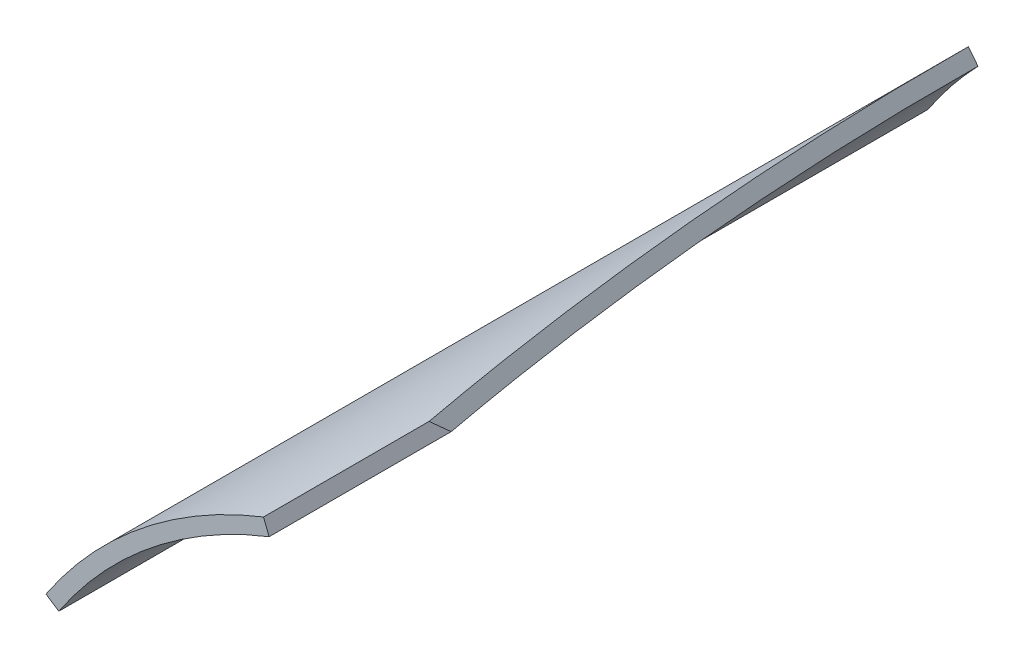
ISO-10303-21;
HEADER;
FILE_DESCRIPTION(('STEP AP214'),'2;1');
FILE_NAME('part.step','',(''),(''),'','','');
FILE_SCHEMA(('AUTOMOTIVE_DESIGN { 1 0 10303 214 1 1 1 1 }'));
ENDSEC;
DATA;
#1=APPLICATION_CONTEXT('core data for automotive mechanical design processes');
#2=APPLICATION_PROTOCOL_DEFINITION('international standard','automotive_design',2000,#1);
#3=PRODUCT_CONTEXT('',#1,'mechanical');
#4=PRODUCT('Part','Part','',(#3));
#5=PRODUCT_RELATED_PRODUCT_CATEGORY('part','',(#4));
#6=PRODUCT_DEFINITION_FORMATION('','',#4);
#7=PRODUCT_DEFINITION_CONTEXT('part definition',#1,'design');
#8=PRODUCT_DEFINITION('design','',#6,#7);
#9=PRODUCT_DEFINITION_SHAPE('','',#8);
#10=(LENGTH_UNIT() NAMED_UNIT(*) SI_UNIT(.MILLI.,.METRE.));
#11=(NAMED_UNIT(*) PLANE_ANGLE_UNIT() SI_UNIT($,.RADIAN.));
#12=(NAMED_UNIT(*) SI_UNIT($,.STERADIAN.) SOLID_ANGLE_UNIT());
#13=UNCERTAINTY_MEASURE_WITH_UNIT(LENGTH_MEASURE(1.E-05),#10,'distance_accuracy_value','');
#14=(GEOMETRIC_REPRESENTATION_CONTEXT(3) GLOBAL_UNCERTAINTY_ASSIGNED_CONTEXT((#13)) GLOBAL_UNIT_ASSIGNED_CONTEXT((#10,
#11,#12)) REPRESENTATION_CONTEXT('',''));
#15=CARTESIAN_POINT('',(0.,0.,0.));
#16=DIRECTION('',(0.,0.,1.));
#17=DIRECTION('',(1.,0.,0.));
#18=AXIS2_PLACEMENT_3D('',#15,#16,#17);
#19=CARTESIAN_POINT('',(0.,0.,-539.));
#20=DIRECTION('',(0.,0.,1.));
#21=DIRECTION('',(1.,0.,0.));
#22=AXIS2_PLACEMENT_3D('',#19,#20,#21);
#23=CYLINDRICAL_SURFACE('',#22,76.);
#24=CARTESIAN_POINT('',(0.,0.,-539.));
#25=DIRECTION('',(0.,0.,-1.));
#26=DIRECTION('',(1.,0.,0.));
#27=AXIS2_PLACEMENT_3D('',#24,#25,#26);
#28=CIRCLE('',#27,76.);
#29=CARTESIAN_POINT('',(-63.3020142939677,42.057757742494,-539.));
#30=VERTEX_POINT('',#29);
#31=CARTESIAN_POINT('',(-54.8388184739976,52.6184757321602,-539.));
#32=VERTEX_POINT('',#31);
#33=EDGE_CURVE('E93',#30,#32,#28,.T.);
#34=ORIENTED_EDGE('',*,*,#33,.T.);
#35=CARTESIAN_POINT('',(0.,0.,-504.536855211114));
#36=DIRECTION('',(0.749500305612505,0.604770507151862,-0.269261816019355));
#37=DIRECTION('',(0.209551163476737,0.169086473295728,0.963067014508315));
#38=AXIS2_PLACEMENT_3D('',#35,#36,#37);
#39=ELLIPSE('',#38,282.253165798068,76.);
#40=CARTESIAN_POINT('',(-27.7306356096592,70.7602420055521,-422.796384523523));
#41=VERTEX_POINT('',#40);
#42=EDGE_CURVE('E78',#32,#41,#39,.T.);
#43=ORIENTED_EDGE('',*,*,#42,.T.);
#44=DIRECTION('',(0.,0.,1.));
#45=VECTOR('',#44,1.);
#46=CARTESIAN_POINT('',(-27.7306356096592,70.7602420055521,-539.));
#47=LINE('',#46,#45);
#48=CARTESIAN_POINT('',(-27.7306356096592,70.7602420055521,-392.));
#49=VERTEX_POINT('',#48);
#50=EDGE_CURVE('E125',#49,#41,#47,.F.);
#51=ORIENTED_EDGE('',*,*,#50,.F.);
#52=CARTESIAN_POINT('',(0.,0.,-392.));
#53=DIRECTION('',(0.,0.,-1.));
#54=DIRECTION('',(1.,0.,0.));
#55=AXIS2_PLACEMENT_3D('',#52,#53,#54);
#56=CIRCLE('',#55,76.);
#57=CARTESIAN_POINT('',(-63.3020142939677,42.057757742494,-392.));
#58=VERTEX_POINT('',#57);
#59=EDGE_CURVE('E103',#58,#49,#56,.T.);
#60=ORIENTED_EDGE('',*,*,#59,.F.);
#61=DIRECTION('',(0.,0.,1.));
#62=VECTOR('',#61,1.);
#63=CARTESIAN_POINT('',(-63.3020142939677,42.057757742494,-539.));
#64=LINE('',#63,#62);
#65=EDGE_CURVE('E98',#30,#58,#64,.T.);
#66=ORIENTED_EDGE('',*,*,#65,.F.);
#67=EDGE_LOOP('',(#34,#43,#51,#60,#66));
#68=FACE_BOUND('',#67,.T.);
#69=ADVANCED_FACE('F35',(#68),#23,.F.);
#70=CARTESIAN_POINT('',(0.,0.,-539.));
#71=DIRECTION('',(0.,0.,1.));
#72=DIRECTION('',(1.,0.,0.));
#73=AXIS2_PLACEMENT_3D('',#70,#71,#72);
#74=CYLINDRICAL_SURFACE('',#73,78.6);
#75=DIRECTION('',(0.,0.,1.));
#76=VECTOR('',#75,1.);
#77=CARTESIAN_POINT('',(-28.679315248937,73.1809871267947,-539.));
#78=LINE('',#77,#76);
#79=CARTESIAN_POINT('',(-28.679315248937,73.1809871267947,-420.));
#80=VERTEX_POINT('',#79);
#81=CARTESIAN_POINT('',(-28.679315248937,73.1809871267947,-392.));
#82=VERTEX_POINT('',#81);
#83=EDGE_CURVE('E55',#80,#82,#78,.T.);
#84=ORIENTED_EDGE('',*,*,#83,.F.);
#85=CARTESIAN_POINT('',(0.,0.,-504.536855211114));
#86=DIRECTION('',(0.749500305612505,0.604770507151862,-0.269261816019355));
#87=DIRECTION('',(0.209551163476737,0.169086473295728,0.963067014508315));
#88=AXIS2_PLACEMENT_3D('',#85,#86,#87);
#89=ELLIPSE('',#88,291.909195154318,78.6);
#90=CARTESIAN_POINT('',(-56.4843601592921,54.6578178982236,-539.));
#91=VERTEX_POINT('',#90);
#92=EDGE_CURVE('E48',#80,#91,#89,.F.);
#93=ORIENTED_EDGE('',*,*,#92,.T.);
#94=CARTESIAN_POINT('',(0.,0.,-539.));
#95=DIRECTION('',(0.,0.,1.));
#96=DIRECTION('',(1.,0.,0.));
#97=AXIS2_PLACEMENT_3D('',#94,#95,#96);
#98=CIRCLE('',#97,78.6);
#99=CARTESIAN_POINT('',(-65.4676095198139,43.4965757705267,-539.));
#100=VERTEX_POINT('',#99);
#101=EDGE_CURVE('E94',#91,#100,#98,.T.);
#102=ORIENTED_EDGE('',*,*,#101,.T.);
#103=DIRECTION('',(0.,0.,1.));
#104=VECTOR('',#103,1.);
#105=CARTESIAN_POINT('',(-65.4676095198139,43.4965757705267,-539.));
#106=LINE('',#105,#104);
#107=CARTESIAN_POINT('',(-65.4676095198139,43.4965757705267,-392.));
#108=VERTEX_POINT('',#107);
#109=EDGE_CURVE('E114',#100,#108,#106,.T.);
#110=ORIENTED_EDGE('',*,*,#109,.T.);
#111=CARTESIAN_POINT('',(0.,0.,-392.));
#112=DIRECTION('',(0.,0.,1.));
#113=DIRECTION('',(1.,0.,0.));
#114=AXIS2_PLACEMENT_3D('',#111,#112,#113);
#115=CIRCLE('',#114,78.6);
#116=EDGE_CURVE('E99',#82,#108,#115,.T.);
#117=ORIENTED_EDGE('',*,*,#116,.F.);
#118=EDGE_LOOP('',(#84,#93,#102,#110,#117));
#119=FACE_BOUND('',#118,.T.);
#120=ADVANCED_FACE('F118',(#119),#74,.T.);
#121=CARTESIAN_POINT('',(0.,0.,-539.));
#122=DIRECTION('',(0.,0.,1.));
#123=DIRECTION('',(1.,0.,0.));
#124=AXIS2_PLACEMENT_3D('',#121,#122,#123);
#125=PLANE('',#124);
#126=DIRECTION('',(-0.627963057649339,0.77824314852602,0.));
#127=VECTOR('',#126,1.);
#128=CARTESIAN_POINT('',(-38.9879358457828,32.9742615491234,-539.));
#129=LINE('',#128,#127);
#130=EDGE_CURVE('E81',#32,#91,#129,.T.);
#131=ORIENTED_EDGE('',*,*,#130,.F.);
#132=ORIENTED_EDGE('',*,*,#33,.F.);
#133=DIRECTION('',(-0.832921240710101,0.553391549243342,0.));
#134=VECTOR('',#133,1.);
#135=CARTESIAN_POINT('',(0.,0.,-539.));
#136=LINE('',#135,#134);
#137=EDGE_CURVE('E119',#30,#100,#136,.T.);
#138=ORIENTED_EDGE('',*,*,#137,.T.);
#139=ORIENTED_EDGE('',*,*,#101,.F.);
#140=EDGE_LOOP('',(#131,#132,#138,#139));
#141=FACE_BOUND('',#140,.T.);
#142=ADVANCED_FACE('F91',(#141),#125,.F.);
#143=CARTESIAN_POINT('',(0.,0.,-539.));
#144=DIRECTION('',(-0.931055815862528,-0.36487678433762,0.));
#145=DIRECTION('',(0.36487678433762,-0.931055815862528,0.));
#146=AXIS2_PLACEMENT_3D('',#143,#144,#145);
#147=PLANE('',#146);
#148=DIRECTION('',(0.248453029628634,-0.633977408632173,-0.732354925847016));
#149=VECTOR('',#148,1.);
#150=CARTESIAN_POINT('',(6.27076908368427,-16.0011167492993,-523.020947090169));
#151=LINE('',#150,#149);
#152=EDGE_CURVE('E12',#80,#41,#151,.T.);
#153=ORIENTED_EDGE('',*,*,#152,.F.);
#154=ORIENTED_EDGE('',*,*,#83,.T.);
#155=DIRECTION('',(0.364876784337621,-0.931055815862528,0.));
#156=VECTOR('',#155,1.);
#157=CARTESIAN_POINT('',(0.,0.,-392.));
#158=LINE('',#157,#156);
#159=EDGE_CURVE('E86',#82,#49,#158,.T.);
#160=ORIENTED_EDGE('',*,*,#159,.T.);
#161=ORIENTED_EDGE('',*,*,#50,.T.);
#162=EDGE_LOOP('',(#153,#154,#160,#161));
#163=FACE_BOUND('',#162,.T.);
#164=ADVANCED_FACE('F126',(#163),#147,.F.);
#165=CARTESIAN_POINT('',(0.,0.,-392.));
#166=DIRECTION('',(0.,0.,1.));
#167=DIRECTION('',(1.,0.,0.));
#168=AXIS2_PLACEMENT_3D('',#165,#166,#167);
#169=PLANE('',#168);
#170=DIRECTION('',(-0.832921240710101,0.553391549243342,0.));
#171=VECTOR('',#170,1.);
#172=CARTESIAN_POINT('',(0.,0.,-392.));
#173=LINE('',#172,#171);
#174=EDGE_CURVE('E42',#58,#108,#173,.T.);
#175=ORIENTED_EDGE('',*,*,#174,.F.);
#176=ORIENTED_EDGE('',*,*,#59,.T.);
#177=ORIENTED_EDGE('',*,*,#159,.F.);
#178=ORIENTED_EDGE('',*,*,#116,.T.);
#179=EDGE_LOOP('',(#175,#176,#177,#178));
#180=FACE_BOUND('',#179,.T.);
#181=ADVANCED_FACE('F121',(#180),#169,.T.);
#182=CARTESIAN_POINT('',(0.,0.,-539.));
#183=DIRECTION('',(0.553391549243342,0.832921240710101,0.));
#184=DIRECTION('',(-0.832921240710101,0.553391549243342,0.));
#185=AXIS2_PLACEMENT_3D('',#182,#183,#184);
#186=PLANE('',#185);
#187=ORIENTED_EDGE('',*,*,#65,.T.);
#188=ORIENTED_EDGE('',*,*,#174,.T.);
#189=ORIENTED_EDGE('',*,*,#109,.F.);
#190=ORIENTED_EDGE('',*,*,#137,.F.);
#191=EDGE_LOOP('',(#187,#188,#189,#190));
#192=FACE_BOUND('',#191,.T.);
#193=ADVANCED_FACE('F113',(#192),#186,.F.);
#194=CARTESIAN_POINT('',(-38.9879358457828,32.9742615491234,-539.));
#195=DIRECTION('',(0.749500305612505,0.604770507151862,-0.269261816019355));
#196=DIRECTION('',(-0.627963057649339,0.77824314852602,0.));
#197=AXIS2_PLACEMENT_3D('',#194,#195,#196);
#198=PLANE('',#197);
#199=ORIENTED_EDGE('',*,*,#130,.T.);
#200=ORIENTED_EDGE('',*,*,#92,.F.);
#201=ORIENTED_EDGE('',*,*,#152,.T.);
#202=ORIENTED_EDGE('',*,*,#42,.F.);
#203=EDGE_LOOP('',(#199,#200,#201,#202));
#204=FACE_BOUND('',#203,.T.);
#205=ADVANCED_FACE('F80',(#204),#198,.T.);
#206=CLOSED_SHELL('',(#69,#120,#142,#164,#181,#193,#205));
#207=MANIFOLD_SOLID_BREP('B2',#206);
#208=ADVANCED_BREP_SHAPE_REPRESENTATION('',(#18,#207),#14);
#209=SHAPE_DEFINITION_REPRESENTATION(#9,#208);
ENDSEC;
END-ISO-10303-21;
